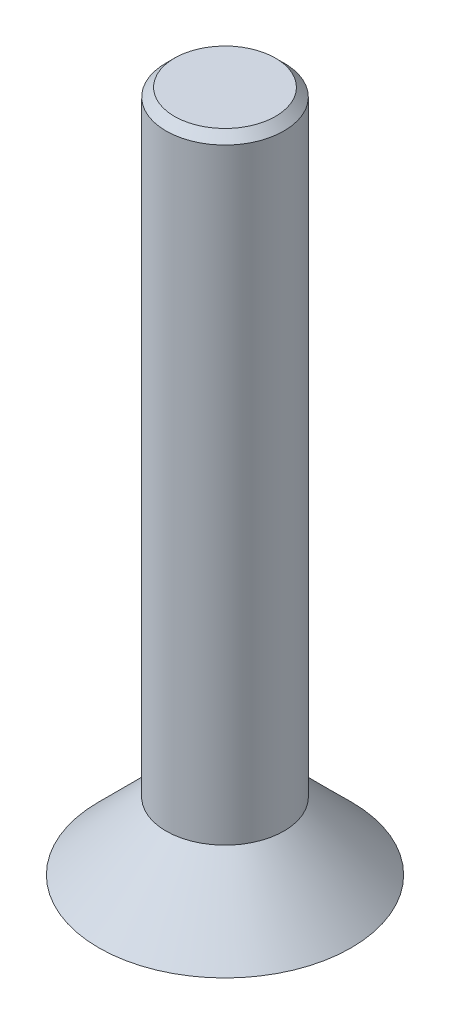
ISO-10303-21;
HEADER;
FILE_DESCRIPTION(('STEP AP214'),'2;1');
FILE_NAME('part.step','',(''),(''),'','','');
FILE_SCHEMA(('AUTOMOTIVE_DESIGN { 1 0 10303 214 1 1 1 1 }'));
ENDSEC;
DATA;
#1=APPLICATION_CONTEXT('core data for automotive mechanical design processes');
#2=APPLICATION_PROTOCOL_DEFINITION('international standard','automotive_design',2000,#1);
#3=PRODUCT_CONTEXT('',#1,'mechanical');
#4=PRODUCT('Part','Part','',(#3));
#5=PRODUCT_RELATED_PRODUCT_CATEGORY('part','',(#4));
#6=PRODUCT_DEFINITION_FORMATION('','',#4);
#7=PRODUCT_DEFINITION_CONTEXT('part definition',#1,'design');
#8=PRODUCT_DEFINITION('design','',#6,#7);
#9=PRODUCT_DEFINITION_SHAPE('','',#8);
#10=(LENGTH_UNIT() NAMED_UNIT(*) SI_UNIT(.MILLI.,.METRE.));
#11=(NAMED_UNIT(*) PLANE_ANGLE_UNIT() SI_UNIT($,.RADIAN.));
#12=(NAMED_UNIT(*) SI_UNIT($,.STERADIAN.) SOLID_ANGLE_UNIT());
#13=UNCERTAINTY_MEASURE_WITH_UNIT(LENGTH_MEASURE(1.E-05),#10,'distance_accuracy_value','');
#14=(GEOMETRIC_REPRESENTATION_CONTEXT(3) GLOBAL_UNCERTAINTY_ASSIGNED_CONTEXT((#13)) GLOBAL_UNIT_ASSIGNED_CONTEXT((#10,
#11,#12)) REPRESENTATION_CONTEXT('',''));
#15=CARTESIAN_POINT('',(0.,0.,0.));
#16=DIRECTION('',(0.,0.,1.));
#17=DIRECTION('',(1.,0.,0.));
#18=AXIS2_PLACEMENT_3D('',#15,#16,#17);
#19=CARTESIAN_POINT('',(0.,0.,0.));
#20=DIRECTION('',(0.,1.,0.));
#21=DIRECTION('',(0.,0.,1.));
#22=AXIS2_PLACEMENT_3D('',#19,#20,#21);
#23=PLANE('',#22);
#24=CARTESIAN_POINT('',(0.,0.,0.));
#25=DIRECTION('',(0.,1.,0.));
#26=DIRECTION('',(0.,0.,1.));
#27=AXIS2_PLACEMENT_3D('',#24,#25,#26);
#28=CIRCLE('',#27,3.);
#29=CARTESIAN_POINT('',(0.,0.,3.));
#30=VERTEX_POINT('',#29);
#31=EDGE_CURVE('E139',#30,#30,#28,.T.);
#32=ORIENTED_EDGE('',*,*,#31,.F.);
#33=EDGE_LOOP('',(#32));
#34=FACE_BOUND('',#33,.T.);
#35=DIRECTION('',(0.866025403784439,0.,0.5));
#36=VECTOR('',#35,1.);
#37=CARTESIAN_POINT('',(-1.,0.,0.577350269189626));
#38=LINE('',#37,#36);
#39=CARTESIAN_POINT('',(-1.,0.,0.577350269189626));
#40=VERTEX_POINT('',#39);
#41=CARTESIAN_POINT('',(0.,0.,1.15470053837925));
#42=VERTEX_POINT('',#41);
#43=EDGE_CURVE('E58',#40,#42,#38,.T.);
#44=ORIENTED_EDGE('',*,*,#43,.T.);
#45=DIRECTION('',(0.866025403784438,0.,-0.5));
#46=VECTOR('',#45,1.);
#47=CARTESIAN_POINT('',(0.,0.,1.15470053837925));
#48=LINE('',#47,#46);
#49=CARTESIAN_POINT('',(1.,0.,0.577350269189626));
#50=VERTEX_POINT('',#49);
#51=EDGE_CURVE('E118',#42,#50,#48,.T.);
#52=ORIENTED_EDGE('',*,*,#51,.T.);
#53=DIRECTION('',(0.,0.,-1.));
#54=VECTOR('',#53,1.);
#55=CARTESIAN_POINT('',(1.,0.,0.577350269189626));
#56=LINE('',#55,#54);
#57=CARTESIAN_POINT('',(0.999999999999999,0.,-0.577350269189626));
#58=VERTEX_POINT('',#57);
#59=EDGE_CURVE('E114',#50,#58,#56,.T.);
#60=ORIENTED_EDGE('',*,*,#59,.T.);
#61=DIRECTION('',(-0.866025403784439,0.,-0.5));
#62=VECTOR('',#61,1.);
#63=CARTESIAN_POINT('',(0.999999999999999,0.,-0.577350269189626));
#64=LINE('',#63,#62);
#65=CARTESIAN_POINT('',(0.,0.,-1.15470053837925));
#66=VERTEX_POINT('',#65);
#67=EDGE_CURVE('E93',#58,#66,#64,.T.);
#68=ORIENTED_EDGE('',*,*,#67,.T.);
#69=DIRECTION('',(-0.866025403784438,0.,0.5));
#70=VECTOR('',#69,1.);
#71=CARTESIAN_POINT('',(0.,0.,-1.15470053837925));
#72=LINE('',#71,#70);
#73=CARTESIAN_POINT('',(-1.,0.,-0.577350269189625));
#74=VERTEX_POINT('',#73);
#75=EDGE_CURVE('E103',#66,#74,#72,.T.);
#76=ORIENTED_EDGE('',*,*,#75,.T.);
#77=DIRECTION('',(0.,0.,1.));
#78=VECTOR('',#77,1.);
#79=CARTESIAN_POINT('',(-1.,0.,-0.577350269189625));
#80=LINE('',#79,#78);
#81=EDGE_CURVE('E110',#74,#40,#80,.T.);
#82=ORIENTED_EDGE('',*,*,#81,.T.);
#83=EDGE_LOOP('',(#44,#52,#60,#68,#76,#82));
#84=FACE_BOUND('',#83,.T.);
#85=ADVANCED_FACE('F41',(#34,#84),#23,.F.);
#86=CARTESIAN_POINT('',(-1.,1.6,0.577350269189626));
#87=DIRECTION('',(0.5,0.,-0.866025403784439));
#88=DIRECTION('',(-0.866025403784439,0.,-0.5));
#89=AXIS2_PLACEMENT_3D('',#86,#87,#88);
#90=PLANE('',#89);
#91=ORIENTED_EDGE('',*,*,#43,.F.);
#92=DIRECTION('',(0.,-1.,0.));
#93=VECTOR('',#92,1.);
#94=CARTESIAN_POINT('',(-1.,1.6,0.577350269189626));
#95=LINE('',#94,#93);
#96=CARTESIAN_POINT('',(-1.,1.6,0.577350269189626));
#97=VERTEX_POINT('',#96);
#98=EDGE_CURVE('E125',#97,#40,#95,.T.);
#99=ORIENTED_EDGE('',*,*,#98,.F.);
#100=DIRECTION('',(0.866025403784439,0.,0.5));
#101=VECTOR('',#100,1.);
#102=CARTESIAN_POINT('',(-1.,1.6,0.577350269189626));
#103=LINE('',#102,#101);
#104=CARTESIAN_POINT('',(0.,1.6,1.15470053837925));
#105=VERTEX_POINT('',#104);
#106=EDGE_CURVE('E124',#97,#105,#103,.T.);
#107=ORIENTED_EDGE('',*,*,#106,.T.);
#108=DIRECTION('',(0.,-1.,0.));
#109=VECTOR('',#108,1.);
#110=CARTESIAN_POINT('',(0.,1.6,1.15470053837925));
#111=LINE('',#110,#109);
#112=EDGE_CURVE('E136',#105,#42,#111,.T.);
#113=ORIENTED_EDGE('',*,*,#112,.T.);
#114=EDGE_LOOP('',(#91,#99,#107,#113));
#115=FACE_BOUND('',#114,.T.);
#116=ADVANCED_FACE('F161',(#115),#90,.T.);
#117=CARTESIAN_POINT('',(0.,1.6,1.15470053837925));
#118=DIRECTION('',(-0.5,0.,-0.866025403784438));
#119=DIRECTION('',(-0.866025403784439,0.,0.5));
#120=AXIS2_PLACEMENT_3D('',#117,#118,#119);
#121=PLANE('',#120);
#122=ORIENTED_EDGE('',*,*,#51,.F.);
#123=ORIENTED_EDGE('',*,*,#112,.F.);
#124=DIRECTION('',(0.866025403784438,0.,-0.5));
#125=VECTOR('',#124,1.);
#126=CARTESIAN_POINT('',(0.,1.6,1.15470053837925));
#127=LINE('',#126,#125);
#128=CARTESIAN_POINT('',(1.,1.6,0.577350269189626));
#129=VERTEX_POINT('',#128);
#130=EDGE_CURVE('E226',#105,#129,#127,.T.);
#131=ORIENTED_EDGE('',*,*,#130,.T.);
#132=DIRECTION('',(0.,-1.,0.));
#133=VECTOR('',#132,1.);
#134=CARTESIAN_POINT('',(1.,1.6,0.577350269189626));
#135=LINE('',#134,#133);
#136=EDGE_CURVE('E133',#129,#50,#135,.T.);
#137=ORIENTED_EDGE('',*,*,#136,.T.);
#138=EDGE_LOOP('',(#122,#123,#131,#137));
#139=FACE_BOUND('',#138,.T.);
#140=ADVANCED_FACE('F167',(#139),#121,.T.);
#141=CARTESIAN_POINT('',(1.,1.6,0.577350269189626));
#142=DIRECTION('',(-1.,0.,0.));
#143=DIRECTION('',(0.,0.,1.));
#144=AXIS2_PLACEMENT_3D('',#141,#142,#143);
#145=PLANE('',#144);
#146=ORIENTED_EDGE('',*,*,#59,.F.);
#147=ORIENTED_EDGE('',*,*,#136,.F.);
#148=DIRECTION('',(0.,0.,-1.));
#149=VECTOR('',#148,1.);
#150=CARTESIAN_POINT('',(1.,1.6,0.577350269189626));
#151=LINE('',#150,#149);
#152=CARTESIAN_POINT('',(0.999999999999999,1.6,-0.577350269189626));
#153=VERTEX_POINT('',#152);
#154=EDGE_CURVE('E223',#129,#153,#151,.T.);
#155=ORIENTED_EDGE('',*,*,#154,.T.);
#156=DIRECTION('',(0.,-1.,0.));
#157=VECTOR('',#156,1.);
#158=CARTESIAN_POINT('',(0.999999999999999,1.6,-0.577350269189626));
#159=LINE('',#158,#157);
#160=EDGE_CURVE('E99',#153,#58,#159,.T.);
#161=ORIENTED_EDGE('',*,*,#160,.T.);
#162=EDGE_LOOP('',(#146,#147,#155,#161));
#163=FACE_BOUND('',#162,.T.);
#164=ADVANCED_FACE('F199',(#163),#145,.T.);
#165=CARTESIAN_POINT('',(0.999999999999999,1.6,-0.577350269189626));
#166=DIRECTION('',(-0.5,0.,0.866025403784439));
#167=DIRECTION('',(0.866025403784439,0.,0.5));
#168=AXIS2_PLACEMENT_3D('',#165,#166,#167);
#169=PLANE('',#168);
#170=ORIENTED_EDGE('',*,*,#67,.F.);
#171=ORIENTED_EDGE('',*,*,#160,.F.);
#172=DIRECTION('',(-0.866025403784439,0.,-0.5));
#173=VECTOR('',#172,1.);
#174=CARTESIAN_POINT('',(0.999999999999999,1.6,-0.577350269189626));
#175=LINE('',#174,#173);
#176=CARTESIAN_POINT('',(0.,1.6,-1.15470053837925));
#177=VERTEX_POINT('',#176);
#178=EDGE_CURVE('E67',#153,#177,#175,.T.);
#179=ORIENTED_EDGE('',*,*,#178,.T.);
#180=DIRECTION('',(0.,-1.,0.));
#181=VECTOR('',#180,1.);
#182=CARTESIAN_POINT('',(0.,1.6,-1.15470053837925));
#183=LINE('',#182,#181);
#184=EDGE_CURVE('E88',#177,#66,#183,.T.);
#185=ORIENTED_EDGE('',*,*,#184,.T.);
#186=EDGE_LOOP('',(#170,#171,#179,#185));
#187=FACE_BOUND('',#186,.T.);
#188=ADVANCED_FACE('F90',(#187),#169,.T.);
#189=CARTESIAN_POINT('',(0.,1.6,-1.15470053837925));
#190=DIRECTION('',(0.5,0.,0.866025403784438));
#191=DIRECTION('',(0.866025403784439,0.,-0.5));
#192=AXIS2_PLACEMENT_3D('',#189,#190,#191);
#193=PLANE('',#192);
#194=ORIENTED_EDGE('',*,*,#75,.F.);
#195=ORIENTED_EDGE('',*,*,#184,.F.);
#196=DIRECTION('',(-0.866025403784438,0.,0.5));
#197=VECTOR('',#196,1.);
#198=CARTESIAN_POINT('',(0.,1.6,-1.15470053837925));
#199=LINE('',#198,#197);
#200=CARTESIAN_POINT('',(-1.,1.6,-0.577350269189625));
#201=VERTEX_POINT('',#200);
#202=EDGE_CURVE('E218',#177,#201,#199,.T.);
#203=ORIENTED_EDGE('',*,*,#202,.T.);
#204=DIRECTION('',(0.,-1.,0.));
#205=VECTOR('',#204,1.);
#206=CARTESIAN_POINT('',(-1.,1.6,-0.577350269189625));
#207=LINE('',#206,#205);
#208=EDGE_CURVE('E100',#201,#74,#207,.T.);
#209=ORIENTED_EDGE('',*,*,#208,.T.);
#210=EDGE_LOOP('',(#194,#195,#203,#209));
#211=FACE_BOUND('',#210,.T.);
#212=ADVANCED_FACE('F104',(#211),#193,.T.);
#213=CARTESIAN_POINT('',(-1.,1.6,-0.577350269189625));
#214=DIRECTION('',(1.,0.,0.));
#215=DIRECTION('',(0.,0.,-1.));
#216=AXIS2_PLACEMENT_3D('',#213,#214,#215);
#217=PLANE('',#216);
#218=ORIENTED_EDGE('',*,*,#81,.F.);
#219=ORIENTED_EDGE('',*,*,#208,.F.);
#220=DIRECTION('',(0.,0.,1.));
#221=VECTOR('',#220,1.);
#222=CARTESIAN_POINT('',(-1.,1.6,-0.577350269189625));
#223=LINE('',#222,#221);
#224=EDGE_CURVE('E128',#201,#97,#223,.T.);
#225=ORIENTED_EDGE('',*,*,#224,.T.);
#226=ORIENTED_EDGE('',*,*,#98,.T.);
#227=EDGE_LOOP('',(#218,#219,#225,#226));
#228=FACE_BOUND('',#227,.T.);
#229=ADVANCED_FACE('F177',(#228),#217,.T.);
#230=CARTESIAN_POINT('',(0.,1.6,0.));
#231=DIRECTION('',(0.,-1.,0.));
#232=DIRECTION('',(0.,0.,-1.));
#233=AXIS2_PLACEMENT_3D('',#230,#231,#232);
#234=CONICAL_SURFACE('',#233,1.4,0.785398163397447);
#235=ORIENTED_EDGE('',*,*,#31,.T.);
#236=EDGE_LOOP('',(#235));
#237=FACE_BOUND('',#236,.T.);
#238=CARTESIAN_POINT('',(0.,1.6,0.));
#239=DIRECTION('',(0.,1.,0.));
#240=DIRECTION('',(0.,0.,1.));
#241=AXIS2_PLACEMENT_3D('',#238,#239,#240);
#242=CIRCLE('',#241,1.4);
#243=CARTESIAN_POINT('',(0.,1.6,1.4));
#244=VERTEX_POINT('',#243);
#245=EDGE_CURVE('E143',#244,#244,#242,.T.);
#246=ORIENTED_EDGE('',*,*,#245,.F.);
#247=EDGE_LOOP('',(#246));
#248=FACE_BOUND('',#247,.T.);
#249=ADVANCED_FACE('F172',(#237,#248),#234,.T.);
#250=CARTESIAN_POINT('',(0.,1.6,0.));
#251=DIRECTION('',(0.,1.,0.));
#252=DIRECTION('',(0.,0.,1.));
#253=AXIS2_PLACEMENT_3D('',#250,#251,#252);
#254=PLANE('',#253);
#255=ORIENTED_EDGE('',*,*,#130,.F.);
#256=ORIENTED_EDGE('',*,*,#106,.F.);
#257=ORIENTED_EDGE('',*,*,#224,.F.);
#258=ORIENTED_EDGE('',*,*,#202,.F.);
#259=ORIENTED_EDGE('',*,*,#178,.F.);
#260=ORIENTED_EDGE('',*,*,#154,.F.);
#261=EDGE_LOOP('',(#255,#256,#257,#258,#259,#260));
#262=FACE_BOUND('',#261,.T.);
#263=ADVANCED_FACE('F176',(#262),#254,.F.);
#264=CARTESIAN_POINT('',(0.,16.2,0.));
#265=DIRECTION('',(0.,-1.,0.));
#266=DIRECTION('',(0.,0.,-1.));
#267=AXIS2_PLACEMENT_3D('',#264,#265,#266);
#268=CYLINDRICAL_SURFACE('',#267,1.4);
#269=CARTESIAN_POINT('',(0.,16.,0.));
#270=DIRECTION('',(0.,1.,0.));
#271=DIRECTION('',(0.,0.,1.));
#272=AXIS2_PLACEMENT_3D('',#269,#270,#271);
#273=CIRCLE('',#272,1.4);
#274=CARTESIAN_POINT('',(0.,16.,1.4));
#275=VERTEX_POINT('',#274);
#276=EDGE_CURVE('E11',#275,#275,#273,.F.);
#277=ORIENTED_EDGE('',*,*,#276,.T.);
#278=EDGE_LOOP('',(#277));
#279=FACE_BOUND('',#278,.T.);
#280=ORIENTED_EDGE('',*,*,#245,.T.);
#281=EDGE_LOOP('',(#280));
#282=FACE_BOUND('',#281,.T.);
#283=ADVANCED_FACE('F157',(#279,#282),#268,.T.);
#284=CARTESIAN_POINT('',(0.,16.2,0.));
#285=DIRECTION('',(0.,1.,0.));
#286=DIRECTION('',(0.,0.,1.));
#287=AXIS2_PLACEMENT_3D('',#284,#285,#286);
#288=PLANE('',#287);
#289=CARTESIAN_POINT('',(0.,16.2,0.));
#290=DIRECTION('',(0.,1.,0.));
#291=DIRECTION('',(0.,0.,1.));
#292=AXIS2_PLACEMENT_3D('',#289,#290,#291);
#293=CIRCLE('',#292,1.2);
#294=CARTESIAN_POINT('',(0.,16.2,1.2));
#295=VERTEX_POINT('',#294);
#296=EDGE_CURVE('E51',#295,#295,#293,.T.);
#297=ORIENTED_EDGE('',*,*,#296,.T.);
#298=EDGE_LOOP('',(#297));
#299=FACE_BOUND('',#298,.T.);
#300=ADVANCED_FACE('F150',(#299),#288,.T.);
#301=CARTESIAN_POINT('',(0.,16.2,0.));
#302=DIRECTION('',(0.,-1.,0.));
#303=DIRECTION('',(0.,0.,-1.));
#304=AXIS2_PLACEMENT_3D('',#301,#302,#303);
#305=CONICAL_SURFACE('',#304,1.2,0.78539816339744);
#306=ORIENTED_EDGE('',*,*,#276,.F.);
#307=EDGE_LOOP('',(#306));
#308=FACE_BOUND('',#307,.T.);
#309=ORIENTED_EDGE('',*,*,#296,.F.);
#310=EDGE_LOOP('',(#309));
#311=FACE_BOUND('',#310,.T.);
#312=ADVANCED_FACE('F44',(#308,#311),#305,.T.);
#313=CLOSED_SHELL('',(#85,#116,#140,#164,#188,#212,#229,#249,#263,#283,#300,#312));
#314=MANIFOLD_SOLID_BREP('B2',#313);
#315=ADVANCED_BREP_SHAPE_REPRESENTATION('',(#18,#314),#14);
#316=SHAPE_DEFINITION_REPRESENTATION(#9,#315);
ENDSEC;
END-ISO-10303-21;
